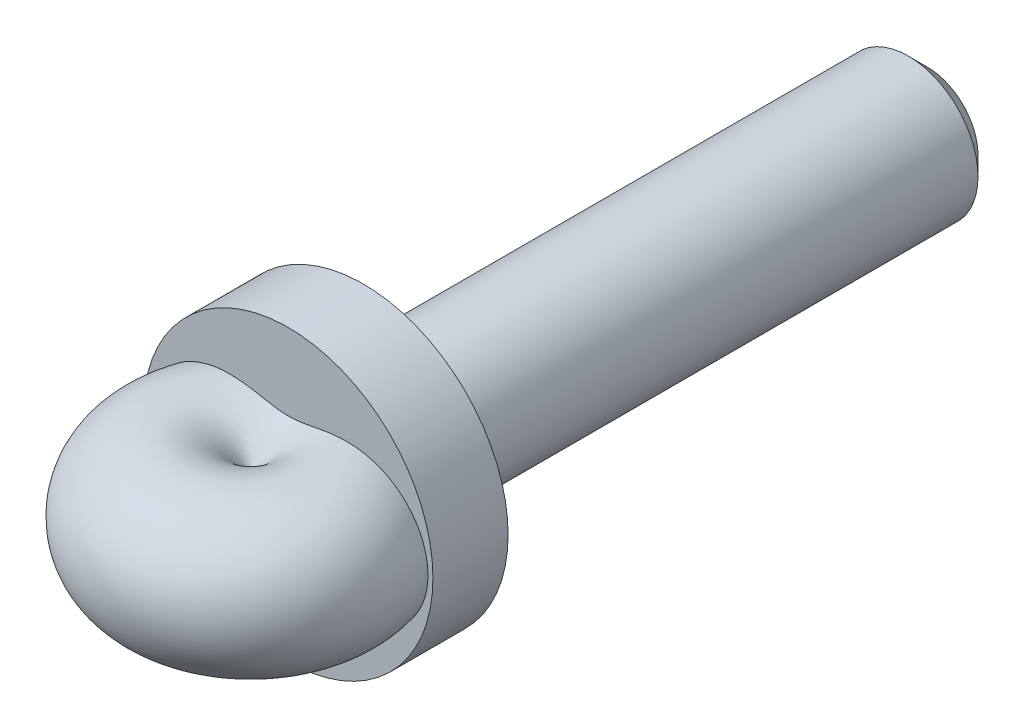
ISO-10303-21;
HEADER;
FILE_DESCRIPTION(('STEP AP214'),'2;1');
FILE_NAME('part.step','',(''),(''),'','','');
FILE_SCHEMA(('AUTOMOTIVE_DESIGN { 1 0 10303 214 1 1 1 1 }'));
ENDSEC;
DATA;
#1=APPLICATION_CONTEXT('core data for automotive mechanical design processes');
#2=APPLICATION_PROTOCOL_DEFINITION('international standard','automotive_design',2000,#1);
#3=PRODUCT_CONTEXT('',#1,'mechanical');
#4=PRODUCT('Part','Part','',(#3));
#5=PRODUCT_RELATED_PRODUCT_CATEGORY('part','',(#4));
#6=PRODUCT_DEFINITION_FORMATION('','',#4);
#7=PRODUCT_DEFINITION_CONTEXT('part definition',#1,'design');
#8=PRODUCT_DEFINITION('design','',#6,#7);
#9=PRODUCT_DEFINITION_SHAPE('','',#8);
#10=(LENGTH_UNIT() NAMED_UNIT(*) SI_UNIT(.MILLI.,.METRE.));
#11=(NAMED_UNIT(*) PLANE_ANGLE_UNIT() SI_UNIT($,.RADIAN.));
#12=(NAMED_UNIT(*) SI_UNIT($,.STERADIAN.) SOLID_ANGLE_UNIT());
#13=UNCERTAINTY_MEASURE_WITH_UNIT(LENGTH_MEASURE(1.E-05),#10,'distance_accuracy_value','');
#14=(GEOMETRIC_REPRESENTATION_CONTEXT(3) GLOBAL_UNCERTAINTY_ASSIGNED_CONTEXT((#13)) GLOBAL_UNIT_ASSIGNED_CONTEXT((#10,
#11,#12)) REPRESENTATION_CONTEXT('',''));
#15=CARTESIAN_POINT('',(0.,0.,0.));
#16=DIRECTION('',(0.,0.,1.));
#17=DIRECTION('',(1.,0.,0.));
#18=AXIS2_PLACEMENT_3D('',#15,#16,#17);
#19=CARTESIAN_POINT('',(0.,0.,38.1));
#20=DIRECTION('',(0.,0.,-1.));
#21=DIRECTION('',(-1.,0.,0.));
#22=AXIS2_PLACEMENT_3D('',#19,#20,#21);
#23=CYLINDRICAL_SURFACE('',#22,4.699);
#24=CARTESIAN_POINT('',(0.,0.,1.27000000000003));
#25=DIRECTION('',(0.,0.,1.));
#26=DIRECTION('',(1.,0.,0.));
#27=AXIS2_PLACEMENT_3D('',#24,#25,#26);
#28=CIRCLE('',#27,4.699);
#29=CARTESIAN_POINT('',(-4.699,0.,1.27000000000002));
#30=VERTEX_POINT('',#29);
#31=EDGE_CURVE('E52',#30,#30,#28,.T.);
#32=CARTESIAN_POINT('',(0.,0.,38.1));
#33=DIRECTION('',(0.,0.,1.));
#34=DIRECTION('',(1.,0.,0.));
#35=AXIS2_PLACEMENT_3D('',#32,#33,#34);
#36=CIRCLE('',#35,4.699);
#37=CARTESIAN_POINT('',(-4.699,0.,38.1));
#38=VERTEX_POINT('',#37);
#39=EDGE_CURVE('E98',#38,#38,#36,.T.);
#40=CARTESIAN_POINT('',(-4.699,0.,1.27000000000002));
#41=CARTESIAN_POINT('',(-4.699,0.,1.65364583333335));
#42=CARTESIAN_POINT('',(-4.699,0.,2.03729166666669));
#43=CARTESIAN_POINT('',(-4.699,0.,2.80458333333335));
#44=CARTESIAN_POINT('',(-4.699,0.,3.18822916666669));
#45=CARTESIAN_POINT('',(-4.699,0.,3.95552083333336));
#46=CARTESIAN_POINT('',(-4.699,0.,4.33916666666669));
#47=CARTESIAN_POINT('',(-4.699,0.,5.10645833333335));
#48=CARTESIAN_POINT('',(-4.699,0.,5.49010416666669));
#49=CARTESIAN_POINT('',(-4.699,0.,6.25739583333335));
#50=CARTESIAN_POINT('',(-4.699,0.,6.64104166666668));
#51=CARTESIAN_POINT('',(-4.699,0.,7.40833333333335));
#52=CARTESIAN_POINT('',(-4.699,0.,7.79197916666668));
#53=CARTESIAN_POINT('',(-4.699,0.,8.55927083333335));
#54=CARTESIAN_POINT('',(-4.699,0.,8.94291666666668));
#55=CARTESIAN_POINT('',(-4.699,0.,9.71020833333335));
#56=CARTESIAN_POINT('',(-4.699,0.,10.0938541666667));
#57=CARTESIAN_POINT('',(-4.699,0.,10.8611458333333));
#58=CARTESIAN_POINT('',(-4.699,0.,11.2447916666667));
#59=CARTESIAN_POINT('',(-4.699,0.,12.0120833333333));
#60=CARTESIAN_POINT('',(-4.699,0.,12.3957291666667));
#61=CARTESIAN_POINT('',(-4.699,0.,13.1630208333333));
#62=CARTESIAN_POINT('',(-4.699,0.,13.5466666666667));
#63=CARTESIAN_POINT('',(-4.699,0.,14.3139583333333));
#64=CARTESIAN_POINT('',(-4.699,0.,14.6976041666667));
#65=CARTESIAN_POINT('',(-4.699,0.,15.4648958333333));
#66=CARTESIAN_POINT('',(-4.699,0.,15.8485416666667));
#67=CARTESIAN_POINT('',(-4.699,0.,16.6158333333333));
#68=CARTESIAN_POINT('',(-4.699,0.,16.9994791666667));
#69=CARTESIAN_POINT('',(-4.699,0.,17.7667708333333));
#70=CARTESIAN_POINT('',(-4.699,0.,18.1504166666667));
#71=CARTESIAN_POINT('',(-4.699,0.,18.9177083333333));
#72=CARTESIAN_POINT('',(-4.699,0.,19.3013541666667));
#73=CARTESIAN_POINT('',(-4.699,0.,20.0686458333333));
#74=CARTESIAN_POINT('',(-4.699,0.,20.4522916666667));
#75=CARTESIAN_POINT('',(-4.699,0.,21.2195833333333));
#76=CARTESIAN_POINT('',(-4.699,0.,21.6032291666667));
#77=CARTESIAN_POINT('',(-4.699,0.,22.3705208333333));
#78=CARTESIAN_POINT('',(-4.699,0.,22.7541666666667));
#79=CARTESIAN_POINT('',(-4.699,0.,23.5214583333333));
#80=CARTESIAN_POINT('',(-4.699,0.,23.9051041666667));
#81=CARTESIAN_POINT('',(-4.699,0.,24.6723958333333));
#82=CARTESIAN_POINT('',(-4.699,0.,25.0560416666667));
#83=CARTESIAN_POINT('',(-4.699,0.,25.8233333333333));
#84=CARTESIAN_POINT('',(-4.699,0.,26.2069791666667));
#85=CARTESIAN_POINT('',(-4.699,0.,26.9742708333333));
#86=CARTESIAN_POINT('',(-4.699,0.,27.3579166666667));
#87=CARTESIAN_POINT('',(-4.699,0.,28.1252083333333));
#88=CARTESIAN_POINT('',(-4.699,0.,28.5088541666667));
#89=CARTESIAN_POINT('',(-4.699,0.,29.2761458333333));
#90=CARTESIAN_POINT('',(-4.699,0.,29.6597916666667));
#91=CARTESIAN_POINT('',(-4.699,0.,30.4270833333333));
#92=CARTESIAN_POINT('',(-4.699,0.,30.8107291666667));
#93=CARTESIAN_POINT('',(-4.699,0.,31.5780208333333));
#94=CARTESIAN_POINT('',(-4.699,0.,31.9616666666667));
#95=CARTESIAN_POINT('',(-4.699,0.,32.7289583333333));
#96=CARTESIAN_POINT('',(-4.699,0.,33.1126041666667));
#97=CARTESIAN_POINT('',(-4.699,0.,33.8798958333333));
#98=CARTESIAN_POINT('',(-4.699,0.,34.2635416666667));
#99=CARTESIAN_POINT('',(-4.699,0.,35.0308333333333));
#100=CARTESIAN_POINT('',(-4.699,0.,35.4144791666667));
#101=CARTESIAN_POINT('',(-4.699,0.,36.1817708333333));
#102=CARTESIAN_POINT('',(-4.699,0.,36.5654166666667));
#103=CARTESIAN_POINT('',(-4.699,0.,37.3327083333333));
#104=CARTESIAN_POINT('',(-4.699,0.,37.7163541666667));
#105=CARTESIAN_POINT('',(-4.699,0.,38.1));
#106=B_SPLINE_CURVE_WITH_KNOTS('',3,(#40,#41,#42,#43,#44,#45,#46,#47,#48,#49,#50,#51,#52,#53,
#54,#55,#56,#57,#58,#59,#60,#61,#62,#63,#64,#65,#66,#67,#68,#69,#70,#71,#72,#73,#74,#75,#76,#77,
#78,#79,#80,#81,#82,#83,#84,#85,#86,#87,#88,#89,#90,#91,#92,#93,#94,#95,#96,#97,#98,#99,#100,
#101,#102,#103,#104,#105),.UNSPECIFIED.,.F.,.F.,(4,2,2,2,2,2,2,2,2,2,2,2,2,2,2,2,2,2,2,2,2,2,2,
2,2,2,2,2,2,2,2,2,4),(0.,1.1509375,2.301875,3.4528125,4.60375,5.75468749999999,6.905625,
8.05656249999999,9.20749999999999,10.3584375,11.509375,12.6603125,13.81125,14.9621875,16.113125,
17.2640625,18.415,19.5659375,20.716875,21.8678125,23.01875,24.1696875,25.320625,26.4715625,
27.6225,28.7734375,29.924375,31.0753125,32.22625,33.3771875,34.528125,35.6790625,36.83),.UNSPECIFIED.);
#107=EDGE_CURVE('BSEAM42',#30,#38,#106,.T.);
#108=ORIENTED_EDGE('',*,*,#31,.T.);
#109=ORIENTED_EDGE('',*,*,#39,.F.);
#110=ORIENTED_EDGE('',*,*,#107,.T.);
#111=ORIENTED_EDGE('',*,*,#107,.F.);
#112=EDGE_LOOP('',(#108,#110,#109,#111));
#113=FACE_BOUND('',#112,.T.);
#114=ADVANCED_FACE('F42',(#113),#23,.T.);
#115=CARTESIAN_POINT('',(0.,0.,0.));
#116=DIRECTION('',(0.,0.,1.));
#117=DIRECTION('',(1.,0.,0.));
#118=AXIS2_PLACEMENT_3D('',#115,#116,#117);
#119=PLANE('',#118);
#120=CARTESIAN_POINT('',(0.,0.,0.));
#121=DIRECTION('',(0.,0.,1.));
#122=DIRECTION('',(1.,0.,0.));
#123=AXIS2_PLACEMENT_3D('',#120,#121,#122);
#124=CIRCLE('',#123,3.42899999999997);
#125=CARTESIAN_POINT('',(3.42899999999997,0.,0.));
#126=VERTEX_POINT('',#125);
#127=EDGE_CURVE('E11',#126,#126,#124,.F.);
#128=ORIENTED_EDGE('',*,*,#127,.T.);
#129=EDGE_LOOP('',(#128));
#130=FACE_BOUND('',#129,.T.);
#131=ADVANCED_FACE('F76',(#130),#119,.F.);
#132=CARTESIAN_POINT('',(0.,0.,43.18));
#133=DIRECTION('',(0.,0.,-1.));
#134=DIRECTION('',(-1.,0.,0.));
#135=AXIS2_PLACEMENT_3D('',#132,#133,#134);
#136=CYLINDRICAL_SURFACE('',#135,9.779);
#137=CARTESIAN_POINT('',(0.,0.,43.18));
#138=DIRECTION('',(0.,0.,1.));
#139=DIRECTION('',(1.,0.,0.));
#140=AXIS2_PLACEMENT_3D('',#137,#138,#139);
#141=CIRCLE('',#140,9.779);
#142=CARTESIAN_POINT('',(9.779,0.,43.18));
#143=VERTEX_POINT('',#142);
#144=EDGE_CURVE('E99',#143,#143,#141,.T.);
#145=ORIENTED_EDGE('',*,*,#144,.F.);
#146=EDGE_LOOP('',(#145));
#147=FACE_BOUND('',#146,.T.);
#148=CARTESIAN_POINT('',(0.,0.,38.1));
#149=DIRECTION('',(0.,0.,1.));
#150=DIRECTION('',(1.,0.,0.));
#151=AXIS2_PLACEMENT_3D('',#148,#149,#150);
#152=CIRCLE('',#151,9.779);
#153=CARTESIAN_POINT('',(9.779,0.,38.1));
#154=VERTEX_POINT('',#153);
#155=EDGE_CURVE('E103',#154,#154,#152,.T.);
#156=ORIENTED_EDGE('',*,*,#155,.T.);
#157=EDGE_LOOP('',(#156));
#158=FACE_BOUND('',#157,.T.);
#159=ADVANCED_FACE('F81',(#147,#158),#136,.T.);
#160=CARTESIAN_POINT('',(0.,0.,43.18));
#161=DIRECTION('',(0.,0.,1.));
#162=DIRECTION('',(1.,0.,0.));
#163=AXIS2_PLACEMENT_3D('',#160,#161,#162);
#164=PLANE('',#163);
#165=CARTESIAN_POINT('',(-9.44337021407082,0.,43.18));
#166=CARTESIAN_POINT('',(-9.44336974157399,-0.138443172028922,43.18));
#167=CARTESIAN_POINT('',(-9.43750514274005,-0.276897591059812,43.18));
#168=CARTESIAN_POINT('',(-9.41408683390898,-0.552866396498104,43.18));
#169=CARTESIAN_POINT('',(-9.39652823569944,-0.690380365492424,43.18));
#170=CARTESIAN_POINT('',(-9.3498229034432,-0.963625504220269,43.18));
#171=CARTESIAN_POINT('',(-9.32065998587648,-1.09935390953231,43.18));
#172=CARTESIAN_POINT('',(-9.2509623908169,-1.36791221229862,43.18));
#173=CARTESIAN_POINT('',(-9.21042344395877,-1.50074100133153,43.18));
#174=CARTESIAN_POINT('',(-9.11836677961372,-1.76230912467026,43.18));
#175=CARTESIAN_POINT('',(-9.06686590512181,-1.89105438850597,43.18));
#176=CARTESIAN_POINT('',(-8.95322869894422,-2.14381792422882,43.18));
#177=CARTESIAN_POINT('',(-8.8910884701053,-2.26783444357032,43.18));
#178=CARTESIAN_POINT('',(-8.75671114681838,-2.51016195508774,43.18));
#179=CARTESIAN_POINT('',(-8.68448075109083,-2.62847666309347,43.18));
#180=CARTESIAN_POINT('',(-8.5304191977488,-2.85873886630481,43.18));
#181=CARTESIAN_POINT('',(-8.44858465540668,-2.97068409599393,43.18));
#182=CARTESIAN_POINT('',(-8.27520841089692,-3.18837729954053,43.18));
#183=CARTESIAN_POINT('',(-8.18358872128198,-3.29406315020324,43.18));
#184=CARTESIAN_POINT('',(-7.99193295528817,-3.49750726090001,43.18));
#185=CARTESIAN_POINT('',(-7.89189664146368,-3.59526529712563,43.18));
#186=CARTESIAN_POINT('',(-7.68417442494119,-3.78225650592041,43.18));
#187=CARTESIAN_POINT('',(-7.57648936025362,-3.87149060988216,43.18));
#188=CARTESIAN_POINT('',(-7.35428996004365,-4.04092857776101,43.18));
#189=CARTESIAN_POINT('',(-7.23977760315948,-4.1211350387335,43.18));
#190=CARTESIAN_POINT('',(-7.00132388751748,-4.27433777073423,43.18));
#191=CARTESIAN_POINT('',(-6.87720569191898,-4.34705875998885,43.18));
#192=CARTESIAN_POINT('',(-6.62354715305639,-4.48222372948953,43.18));
#193=CARTESIAN_POINT('',(-6.49400835213815,-4.54467060846129,43.18));
#194=CARTESIAN_POINT('',(-6.23024183796137,-4.65919766311756,43.18));
#195=CARTESIAN_POINT('',(-6.09600851307773,-4.71126489637598,43.18));
#196=CARTESIAN_POINT('',(-5.82396600361641,-4.80487019919086,43.18));
#197=CARTESIAN_POINT('',(-5.68615768473988,-4.84641079206364,43.18));
#198=CARTESIAN_POINT('',(-5.39889239792997,-4.92139852331049,43.18));
#199=CARTESIAN_POINT('',(-5.24925538769531,-4.95415528057454,43.18));
#200=CARTESIAN_POINT('',(-4.94792882834002,-5.00815296408193,43.18));
#201=CARTESIAN_POINT('',(-4.79623920126629,-5.02939345170179,43.18));
#202=CARTESIAN_POINT('',(-4.49208502832763,-5.06082276496615,43.18));
#203=CARTESIAN_POINT('',(-4.33962304098011,-5.07103670157533,43.18));
#204=CARTESIAN_POINT('',(-4.0343520445951,-5.08122825463512,43.18));
#205=CARTESIAN_POINT('',(-3.88154297874255,-5.08120405304012,43.18));
#206=CARTESIAN_POINT('',(-3.55109755700651,-5.07112765314464,43.18));
#207=CARTESIAN_POINT('',(-3.37351395594836,-5.05942579876192,43.18));
#208=CARTESIAN_POINT('',(-3.01939807340063,-5.02554292493502,43.18));
#209=CARTESIAN_POINT('',(-2.84286582100109,-5.00336161688372,43.18));
#210=CARTESIAN_POINT('',(-2.49060588072645,-4.95128660097807,43.18));
#211=CARTESIAN_POINT('',(-2.31488069001091,-4.92137665196605,43.18));
#212=CARTESIAN_POINT('',(-1.96409284796635,-4.85768270791207,43.18));
#213=CARTESIAN_POINT('',(-1.78903052703254,-4.82389699123891,43.18));
#214=CARTESIAN_POINT('',(-1.4385423307304,-4.75761128877003,43.18));
#215=CARTESIAN_POINT('',(-1.26311631958512,-4.72511193881576,43.18));
#216=CARTESIAN_POINT('',(-0.999043335071421,-4.68228890098229,43.18));
#217=CARTESIAN_POINT('',(-0.910892410464576,-4.66900560569848,43.18));
#218=CARTESIAN_POINT('',(-0.734213151238241,-4.64528916329775,43.18));
#219=CARTESIAN_POINT('',(-0.645684874178568,-4.63485559625637,43.18));
#220=CARTESIAN_POINT('',(-0.467935428782927,-4.6175864212654,43.18));
#221=CARTESIAN_POINT('',(-0.378712907855124,-4.61076435576395,43.18));
#222=CARTESIAN_POINT('',(-0.200035855562327,-4.60135732546805,43.18));
#223=CARTESIAN_POINT('',(-0.110581317919244,-4.59877247655119,43.18));
#224=CARTESIAN_POINT('',(0.0683207068759989,-4.59807448351473,43.18));
#225=CARTESIAN_POINT('',(0.157768188931769,-4.59996008158684,43.18));
#226=CARTESIAN_POINT('',(0.336440698919299,-4.60802655917103,43.18));
#227=CARTESIAN_POINT('',(0.425665776538198,-4.6142063728574,43.18));
#228=CARTESIAN_POINT('',(0.623061366419988,-4.63208101159652,43.18));
#229=CARTESIAN_POINT('',(0.731148221194525,-4.64468063058687,43.18));
#230=CARTESIAN_POINT('',(0.946761839318344,-4.67405065884486,43.18));
#231=CARTESIAN_POINT('',(1.05428843669398,-4.69082223946722,43.18));
#232=CARTESIAN_POINT('',(1.26904476267453,-4.72697247477446,43.18));
#233=CARTESIAN_POINT('',(1.37627386649662,-4.74635473969864,43.18));
#234=CARTESIAN_POINT('',(1.59051769383172,-4.78619562677604,43.18));
#235=CARTESIAN_POINT('',(1.69753243421251,-4.80665416048499,43.18));
#236=CARTESIAN_POINT('',(1.9120327348337,-4.84740159536572,43.18));
#237=CARTESIAN_POINT('',(2.01951848757458,-4.86768950946286,43.18));
#238=CARTESIAN_POINT('',(2.23474706884382,-4.9068774683213,43.18));
#239=CARTESIAN_POINT('',(2.3424898980664,-4.92577750933024,43.18));
#240=CARTESIAN_POINT('',(2.55827103767645,-4.96122484443074,43.18));
#241=CARTESIAN_POINT('',(2.66630899598783,-4.97777423533544,43.18));
#242=CARTESIAN_POINT('',(2.88281428908852,-5.00775941102664,43.18));
#243=CARTESIAN_POINT('',(2.99128162117453,-5.02119521538449,43.18));
#244=CARTESIAN_POINT('',(3.31328108294727,-5.05539479999478,43.18));
#245=CARTESIAN_POINT('',(3.52743958983538,-5.07076230028785,43.18));
#246=CARTESIAN_POINT('',(3.95646866969247,-5.0831097772318,43.18));
#247=CARTESIAN_POINT('',(4.17133953530849,-5.08008091715568,43.18));
#248=CARTESIAN_POINT('',(4.59916235345778,-5.0531176266696,43.18));
#249=CARTESIAN_POINT('',(4.81211818431865,-5.02924784091127,43.18));
#250=CARTESIAN_POINT('',(5.23419409091409,-4.9591095967574,43.18));
#251=CARTESIAN_POINT('',(5.44331761287259,-4.91286240233762,43.18));
#252=CARTESIAN_POINT('',(5.78788687882883,-4.81610688405471,43.18));
#253=CARTESIAN_POINT('',(5.92512834377545,-4.77190178934062,43.18));
#254=CARTESIAN_POINT('',(6.19572180240929,-4.6729608535036,43.18));
#255=CARTESIAN_POINT('',(6.32907531668671,-4.6182291947457,43.18));
#256=CARTESIAN_POINT('',(6.59267755084292,-4.49754409425388,43.18));
#257=CARTESIAN_POINT('',(6.72286469052004,-4.43145599570722,43.18));
#258=CARTESIAN_POINT('',(6.97737526855593,-4.28877936957879,43.18));
#259=CARTESIAN_POINT('',(7.10169816939428,-4.21218988193599,43.18));
#260=CARTESIAN_POINT('',(7.3432882138855,-4.04902195757776,43.18));
#261=CARTESIAN_POINT('',(7.46056757698803,-3.96246162783262,43.18));
#262=CARTESIAN_POINT('',(7.68742230604249,-3.77969122133163,43.18));
#263=CARTESIAN_POINT('',(7.79699499762093,-3.68347782259274,43.18));
#264=CARTESIAN_POINT('',(8.00700739144765,-3.48249756935921,43.18));
#265=CARTESIAN_POINT('',(8.10748773350825,-3.37777319935612,43.18));
#266=CARTESIAN_POINT('',(8.29910844186862,-3.16003124996061,43.18));
#267=CARTESIAN_POINT('',(8.3902454670496,-3.04701072853005,43.18));
#268=CARTESIAN_POINT('',(8.56154014218453,-2.81463933005334,43.18));
#269=CARTESIAN_POINT('',(8.6417965464961,-2.69536126067265,43.18));
#270=CARTESIAN_POINT('',(8.79174083241594,-2.45027277196852,43.18));
#271=CARTESIAN_POINT('',(8.86142470867218,-2.32445990107608,43.18));
#272=CARTESIAN_POINT('',(8.98966551923557,-2.06714665126254,43.18));
#273=CARTESIAN_POINT('',(9.04821265566863,-1.9356413879914,43.18));
#274=CARTESIAN_POINT('',(9.15363405520069,-1.66797430860733,43.18));
#275=CARTESIAN_POINT('',(9.20050405224818,-1.53181081128611,43.18));
#276=CARTESIAN_POINT('',(9.28094457732879,-1.2599742689551,43.18));
#277=CARTESIAN_POINT('',(9.3148663742391,-1.12440505376297,43.18));
#278=CARTESIAN_POINT('',(9.37105866382511,-0.85081927545774,43.18));
#279=CARTESIAN_POINT('',(9.39332487253478,-0.712801831750313,43.18));
#280=CARTESIAN_POINT('',(9.42599452376804,-0.435491409725392,43.18));
#281=CARTESIAN_POINT('',(9.4364082195155,-0.296199639113778,43.18));
#282=CARTESIAN_POINT('',(9.44532645010579,-0.0171718544104231,43.18));
#283=CARTESIAN_POINT('',(9.44382561771578,0.122564331544839,43.18));
#284=CARTESIAN_POINT('',(9.42899686056096,0.399854218546839,43.18));
#285=CARTESIAN_POINT('',(9.41580008139255,0.537414952995389,43.18));
#286=CARTESIAN_POINT('',(9.37786243907179,0.810935164395467,43.18));
#287=CARTESIAN_POINT('',(9.35312158574465,0.946894642709729,43.18));
#288=CARTESIAN_POINT('',(9.29228047247536,1.21628588846881,43.18));
#289=CARTESIAN_POINT('',(9.25617712897266,1.34971695931895,43.18));
#290=CARTESIAN_POINT('',(9.17290929528576,1.61302760484061,43.18));
#291=CARTESIAN_POINT('',(9.12574882475539,1.74290845102979,43.18));
#292=CARTESIAN_POINT('',(9.02063647616195,1.9984817413314,43.18));
#293=CARTESIAN_POINT('',(8.96266659900573,2.12416678120688,43.18));
#294=CARTESIAN_POINT('',(8.83645808238482,2.37021290136318,43.18));
#295=CARTESIAN_POINT('',(8.7682230748162,2.49057584523839,43.18));
#296=CARTESIAN_POINT('',(8.62197605815312,2.72524294299,43.18));
#297=CARTESIAN_POINT('',(8.54396188329457,2.83954574674053,43.18));
#298=CARTESIAN_POINT('',(8.37879001154329,3.06127879870332,43.18));
#299=CARTESIAN_POINT('',(8.29163540663355,3.16871135128321,43.18));
#300=CARTESIAN_POINT('',(8.10753699041708,3.37751978221377,43.18));
#301=CARTESIAN_POINT('',(8.01047341087844,3.47879005485797,43.18));
#302=CARTESIAN_POINT('',(7.80836925957664,3.67295650035502,43.18));
#303=CARTESIAN_POINT('',(7.70333128460435,3.76585537790998,43.18));
#304=CARTESIAN_POINT('',(7.48595680671536,3.94284849777222,43.18));
#305=CARTESIAN_POINT('',(7.37361496964004,4.02693618533637,43.18));
#306=CARTESIAN_POINT('',(7.14256510350233,4.18576602218248,43.18));
#307=CARTESIAN_POINT('',(7.0238590160127,4.2605109987687,43.18));
#308=CARTESIAN_POINT('',(6.77687914374764,4.40266591514914,43.18));
#309=CARTESIAN_POINT('',(6.64841879080258,4.46975165415861,43.18));
#310=CARTESIAN_POINT('',(6.38652117575728,4.59338588622002,43.18));
#311=CARTESIAN_POINT('',(6.25308356148536,4.64993363194059,43.18));
#312=CARTESIAN_POINT('',(5.98233473688001,4.75232221819912,43.18));
#313=CARTESIAN_POINT('',(5.84502788380775,4.79817460235462,43.18));
#314=CARTESIAN_POINT('',(5.56735225600472,4.87927712821073,43.18));
#315=CARTESIAN_POINT('',(5.42698395771458,4.91452890719138,43.18));
#316=CARTESIAN_POINT('',(5.13402127732746,4.97675039447652,43.18));
#317=CARTESIAN_POINT('',(4.98126503600605,5.00295679913911,43.18));
#318=CARTESIAN_POINT('',(4.67414835304553,5.04386958383148,43.18));
#319=CARTESIAN_POINT('',(4.51978702322267,5.058569211169,43.18));
#320=CARTESIAN_POINT('',(4.20991252655209,5.07713571586335,43.18));
#321=CARTESIAN_POINT('',(4.05439723264192,5.08096607027893,43.18));
#322=CARTESIAN_POINT('',(3.74370450984475,5.07862472795728,43.18));
#323=CARTESIAN_POINT('',(3.58852692809153,5.0724683269485,43.18));
#324=CARTESIAN_POINT('',(3.26108852314013,5.05020753613767,43.18));
#325=CARTESIAN_POINT('',(3.08890208684148,5.03304666756705,43.18));
#326=CARTESIAN_POINT('',(2.74561574778276,4.99011903039007,43.18));
#327=CARTESIAN_POINT('',(2.57451608522192,4.96435042242177,43.18));
#328=CARTESIAN_POINT('',(2.23256142184229,4.90711449809917,43.18));
#329=CARTESIAN_POINT('',(2.061710558195,4.87562340552728,43.18));
#330=CARTESIAN_POINT('',(1.72024240509467,4.81110316170713,43.18));
#331=CARTESIAN_POINT('',(1.549625254295,4.77807332881617,43.18));
#332=CARTESIAN_POINT('',(1.20817337682673,4.71602150819986,43.18));
#333=CARTESIAN_POINT('',(1.0373412087871,4.6869867034225,43.18));
#334=CARTESIAN_POINT('',(0.780067703310245,4.65111152265278,43.18));
#335=CARTESIAN_POINT('',(0.694177838508701,4.64043571059112,43.18));
#336=CARTESIAN_POINT('',(0.522058079937323,4.62237656381682,43.18));
#337=CARTESIAN_POINT('',(0.43582823968726,4.61499273023325,43.18));
#338=CARTESIAN_POINT('',(0.26361263654032,4.60412119237931,43.18));
#339=CARTESIAN_POINT('',(0.177628305650225,4.6006114088235,43.18));
#340=CARTESIAN_POINT('',(0.0055895619883628,4.59770307203097,43.18));
#341=CARTESIAN_POINT('',(-0.0804648496726432,4.59830445485434,43.18));
#342=CARTESIAN_POINT('',(-0.252493575039425,4.60356971945293,43.18));
#343=CARTESIAN_POINT('',(-0.338467817934732,4.6082358522404,43.18));
#344=CARTESIAN_POINT('',(-0.510133895331118,4.62125035506254,43.18));
#345=CARTESIAN_POINT('',(-0.59582571607651,4.62959890185915,43.18));
#346=CARTESIAN_POINT('',(-0.833628857531092,4.65708221289118,43.18));
#347=CARTESIAN_POINT('',(-0.985346438622595,4.67954876843658,43.18));
#348=CARTESIAN_POINT('',(-1.28783952301881,4.72985313543425,43.18));
#349=CARTESIAN_POINT('',(-1.43861489377308,4.75769168580743,43.18));
#350=CARTESIAN_POINT('',(-1.7408028284887,4.81471836056658,43.18));
#351=CARTESIAN_POINT('',(-1.89221406881832,4.84391332691987,43.18));
#352=CARTESIAN_POINT('',(-2.19544007934088,4.90005331723926,43.18));
#353=CARTESIAN_POINT('',(-2.34725477317469,4.92699873946506,43.18));
#354=CARTESIAN_POINT('',(-2.65201141539505,4.97601751510755,43.18));
#355=CARTESIAN_POINT('',(-2.80495502732278,4.99808085911156,43.18));
#356=CARTESIAN_POINT('',(-3.11173026198451,5.03519262048277,43.18));
#357=CARTESIAN_POINT('',(-3.26556195110473,5.05024050636701,43.18));
#358=CARTESIAN_POINT('',(-3.57349689293069,5.07169378291213,43.18));
#359=CARTESIAN_POINT('',(-3.72759870797872,5.07811896550773,43.18));
#360=CARTESIAN_POINT('',(-4.03588139219553,5.08117027116441,43.18));
#361=CARTESIAN_POINT('',(-4.19006223067303,5.0777989242835,43.18));
#362=CARTESIAN_POINT('',(-4.49996619060002,5.06022207950449,43.18));
#363=CARTESIAN_POINT('',(-4.65568114108254,5.04586734776276,43.18));
#364=CARTESIAN_POINT('',(-4.96562290510676,5.00545459654023,43.18));
#365=CARTESIAN_POINT('',(-5.1198495171406,4.97939501441873,43.18));
#366=CARTESIAN_POINT('',(-5.42667837368564,4.91493207655944,43.18));
#367=CARTESIAN_POINT('',(-5.5792654324961,4.87645598696255,43.18));
#368=CARTESIAN_POINT('',(-5.88071810603562,4.7869791405814,43.18));
#369=CARTESIAN_POINT('',(-6.02958409451843,4.7359796472945,43.18));
#370=CARTESIAN_POINT('',(-6.3229291404276,4.62123105747655,43.18));
#371=CARTESIAN_POINT('',(-6.46739109815859,4.55743814059934,43.18));
#372=CARTESIAN_POINT('',(-6.75015454473473,4.417388074155,43.18));
#373=CARTESIAN_POINT('',(-6.88845593734013,4.34113072995662,43.18));
#374=CARTESIAN_POINT('',(-7.15728642180492,4.17674662400019,43.18));
#375=CARTESIAN_POINT('',(-7.28783634124267,4.08865395717184,43.18));
#376=CARTESIAN_POINT('',(-7.54038990557624,3.90096765272083,43.18));
#377=CARTESIAN_POINT('',(-7.6623940180647,3.80137464514214,43.18));
#378=CARTESIAN_POINT('',(-7.89036721629185,3.59707098216292,43.18));
#379=CARTESIAN_POINT('',(-7.99684688121017,3.49292962106457,43.18));
#380=CARTESIAN_POINT('',(-8.20023439191785,3.27568381745566,43.18));
#381=CARTESIAN_POINT('',(-8.29714253782678,3.16257965617853,43.18));
#382=CARTESIAN_POINT('',(-8.48065392281983,2.92808511362903,43.18));
#383=CARTESIAN_POINT('',(-8.56724506731529,2.80668526453561,43.18));
#384=CARTESIAN_POINT('',(-8.72922636107348,2.55663419080146,43.18));
#385=CARTESIAN_POINT('',(-8.80461715950989,2.42798338702376,43.18));
#386=CARTESIAN_POINT('',(-8.94018050986151,2.17078676090182,43.18));
#387=CARTESIAN_POINT('',(-9.00091154969629,2.04253494980583,43.18));
#388=CARTESIAN_POINT('',(-9.11113064173516,1.78129242935914,43.18));
#389=CARTESIAN_POINT('',(-9.16061933169134,1.64830198931508,43.18));
#390=CARTESIAN_POINT('',(-9.24786310476519,1.37882915115505,43.18));
#391=CARTESIAN_POINT('',(-9.28564200139243,1.24235445909962,43.18));
#392=CARTESIAN_POINT('',(-9.34928201417497,0.966708610499099,43.18));
#393=CARTESIAN_POINT('',(-9.37514831746449,0.82753865512078,43.18));
#394=CARTESIAN_POINT('',(-9.41106895396965,0.57369122650083,43.18));
#395=CARTESIAN_POINT('',(-9.42317545134927,0.459299595388638,43.18));
#396=CARTESIAN_POINT('',(-9.4393265129881,0.2299412506614,43.18));
#397=CARTESIAN_POINT('',(-9.44337060647073,0.114974503857362,43.18));
#398=CARTESIAN_POINT('',(-9.44337021407082,0.,43.18));
#399=B_SPLINE_CURVE_WITH_KNOTS('',3,(#165,#166,#167,#168,#169,#170,#171,#172,#173,#174,#175,
#176,#177,#178,#179,#180,#181,#182,#183,#184,#185,#186,#187,#188,#189,#190,#191,#192,#193,#194,
#195,#196,#197,#198,#199,#200,#201,#202,#203,#204,#205,#206,#207,#208,#209,#210,#211,#212,#213,
#214,#215,#216,#217,#218,#219,#220,#221,#222,#223,#224,#225,#226,#227,#228,#229,#230,#231,#232,
#233,#234,#235,#236,#237,#238,#239,#240,#241,#242,#243,#244,#245,#246,#247,#248,#249,#250,#251,
#252,#253,#254,#255,#256,#257,#258,#259,#260,#261,#262,#263,#264,#265,#266,#267,#268,#269,#270,
#271,#272,#273,#274,#275,#276,#277,#278,#279,#280,#281,#282,#283,#284,#285,#286,#287,#288,#289,
#290,#291,#292,#293,#294,#295,#296,#297,#298,#299,#300,#301,#302,#303,#304,#305,#306,#307,#308,
#309,#310,#311,#312,#313,#314,#315,#316,#317,#318,#319,#320,#321,#322,#323,#324,#325,#326,#327,
#328,#329,#330,#331,#332,#333,#334,#335,#336,#337,#338,#339,#340,#341,#342,#343,#344,#345,#346,
#347,#348,#349,#350,#351,#352,#353,#354,#355,#356,#357,#358,#359,#360,#361,#362,#363,#364,#365,
#366,#367,#368,#369,#370,#371,#372,#373,#374,#375,#376,#377,#378,#379,#380,#381,#382,#383,#384,
#385,#386,#387,#388,#389,#390,#391,#392,#393,#394,#395,#396,#397,#398),.UNSPECIFIED.,.T.,.F.,(4,
2,2,2,2,2,2,2,2,2,2,2,2,2,2,2,2,2,2,2,2,2,2,2,2,2,2,2,2,2,2,2,2,2,2,2,2,2,2,2,2,2,2,2,2,2,2,2,2,
2,2,2,2,2,2,2,2,2,2,2,2,2,2,2,2,2,2,2,2,2,2,2,2,2,2,2,2,2,2,2,2,2,2,2,2,2,2,2,2,2,2,2,2,2,2,2,2,
2,2,2,2,2,2,2,2,2,2,2,2,2,2,2,2,2,2,2,4),(0.,0.415225116043013,0.830623909499837,
1.24660406487891,1.66274054473668,2.07824218814673,2.49389635504604,2.90927587491573,
3.32480222641656,3.74393007762213,4.16306975702101,4.58216358537252,5.00113653977445,
5.43221491387706,5.86317145467477,6.2946620414428,6.72604909856316,7.18511725871716,
7.64420290230448,8.10224084194771,8.5603601180802,9.09387227199683,9.62739911984651,
10.1620563836391,10.6969520706984,11.2321089324338,11.4995120140305,11.7668756709033,
12.0352349139452,12.3036014958387,12.5718925788722,12.8401170957457,13.166455291745,
13.4928852167993,13.8197712777307,14.146630518059,14.4747787022565,14.8029277736308,
15.1307822679724,15.4586347014338,16.1020883193433,16.7458510458696,17.3876240065628,
18.0287883210845,18.4609492016814,18.8929387315317,19.3304570774756,19.7680154490512,
20.20479138623,20.6417181533513,21.0765840715734,21.5116049569868,21.9423669301983,
22.3732916902239,22.8045938330469,23.2360533147416,23.6547960794279,24.073692643512,
24.4922265577054,24.9109490229155,25.3250349677906,25.7391205602362,26.1533186245613,
26.5673663461858,26.9821097705585,27.3967067985711,27.8113958089596,28.2259449899626,
28.6462866738954,29.0664920596283,29.4870078541916,29.9073960819823,30.3416827188307,
30.7760001426233,31.2098466112559,31.6436260371659,32.1081245153506,32.5728953781161,
33.0392261256008,33.5048433143796,34.0236725822697,34.5426127882224,35.0637605879852,
35.5851414866948,36.1048085883126,36.3644088126344,36.6239696833997,36.8820434816764,
37.1401132662067,37.3983260577658,37.6565512453139,38.1164453275015,38.5764027135284,
39.0390058951213,39.5015270029163,39.964987778174,40.4284836589775,40.8909138344973,
41.353224593117,41.8219309331753,42.2906998658669,42.76226619272,43.2337849623597,
43.7069472556436,44.180116938033,44.651951637799,45.1237605004434,45.5700166172165,
46.0162587369704,46.4630189424399,46.9097532435122,47.3349482438417,47.7601191178315,
48.1844195865017,48.6085351257304,48.9533518011856,49.2981886104447),.UNSPECIFIED.);
#400=CARTESIAN_POINT('',(-9.44337021407082,0.,43.18));
#401=VERTEX_POINT('',#400);
#402=EDGE_CURVE('E92',#401,#401,#399,.T.);
#403=ORIENTED_EDGE('',*,*,#402,.F.);
#404=EDGE_LOOP('',(#403));
#405=FACE_BOUND('',#404,.T.);
#406=ORIENTED_EDGE('',*,*,#144,.T.);
#407=EDGE_LOOP('',(#406));
#408=FACE_BOUND('',#407,.T.);
#409=ADVANCED_FACE('F69',(#405,#408),#164,.T.);
#410=CARTESIAN_POINT('',(0.,0.,38.1));
#411=DIRECTION('',(0.,0.,1.));
#412=DIRECTION('',(1.,0.,0.));
#413=AXIS2_PLACEMENT_3D('',#410,#411,#412);
#414=PLANE('',#413);
#415=ORIENTED_EDGE('',*,*,#39,.T.);
#416=EDGE_LOOP('',(#415));
#417=FACE_BOUND('',#416,.T.);
#418=ORIENTED_EDGE('',*,*,#155,.F.);
#419=EDGE_LOOP('',(#418));
#420=FACE_BOUND('',#419,.T.);
#421=ADVANCED_FACE('F60',(#417,#420),#414,.F.);
#422=CARTESIAN_POINT('',(4.699,0.,45.72));
#423=DIRECTION('',(0.,0.,-1.));
#424=DIRECTION('',(1.,0.,0.));
#425=AXIS2_PLACEMENT_3D('',#422,#423,#424);
#426=CIRCLE('',#425,5.08);
#427=TRIMMED_CURVE('',#426,(PARAMETER_VALUE(-2.75183192079232)),
(PARAMETER_VALUE(2.75183192079232)),.T.,.PARAMETER.);
#428=CARTESIAN_POINT('',(0.,0.,45.72));
#429=DIRECTION('',(0.,-1.,0.));
#430=AXIS1_PLACEMENT('',#428,#429);
#431=SURFACE_OF_REVOLUTION('',#427,#430);
#432=ORIENTED_EDGE('',*,*,#402,.T.);
#433=EDGE_LOOP('',(#432));
#434=FACE_BOUND('',#433,.T.);
#435=CARTESIAN_POINT('',(0.,1.93023288750347,45.72));
#436=VERTEX_POINT('',#435);
#437=VERTEX_LOOP('',#436);
#438=FACE_BOUND('',#437,.T.);
#439=CARTESIAN_POINT('',(0.,-1.93023288750347,45.72));
#440=VERTEX_POINT('',#439);
#441=VERTEX_LOOP('',#440);
#442=FACE_BOUND('',#441,.T.);
#443=ADVANCED_FACE('F58',(#434,#438,#442),#431,.T.);
#444=CARTESIAN_POINT('',(0.,0.,1.27000000000003));
#445=DIRECTION('',(0.,0.,1.));
#446=DIRECTION('',(1.,0.,0.));
#447=AXIS2_PLACEMENT_3D('',#444,#445,#446);
#448=CONICAL_SURFACE('',#447,4.699,0.785398163397451);
#449=ORIENTED_EDGE('',*,*,#127,.F.);
#450=EDGE_LOOP('',(#449));
#451=FACE_BOUND('',#450,.T.);
#452=ORIENTED_EDGE('',*,*,#31,.F.);
#453=EDGE_LOOP('',(#452));
#454=FACE_BOUND('',#453,.T.);
#455=ADVANCED_FACE('F45',(#451,#454),#448,.T.);
#456=CLOSED_SHELL('',(#114,#131,#159,#409,#421,#443,#455));
#457=MANIFOLD_SOLID_BREP('B2',#456);
#458=ADVANCED_BREP_SHAPE_REPRESENTATION('',(#18,#457),#14);
#459=SHAPE_DEFINITION_REPRESENTATION(#9,#458);
ENDSEC;
END-ISO-10303-21;
